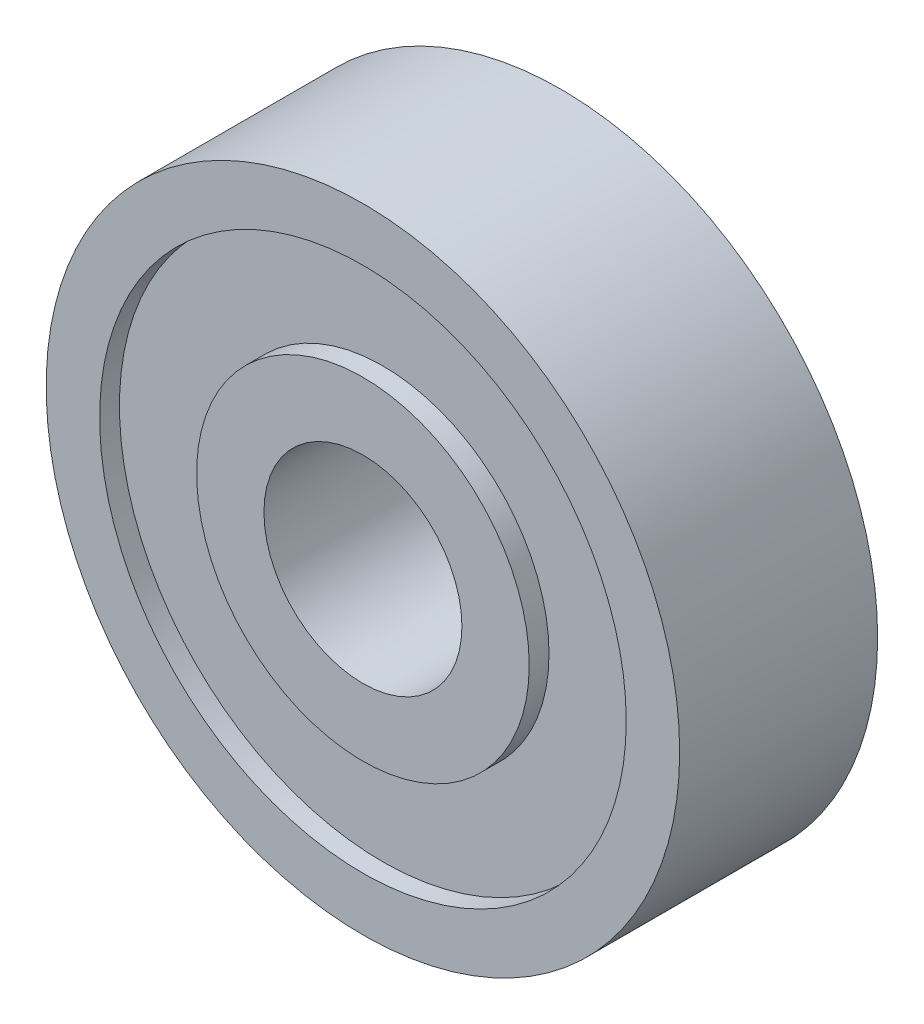
ISO-10303-21;
HEADER;
FILE_DESCRIPTION(('STEP AP214'),'2;1');
FILE_NAME('part.step','',(''),(''),'','','');
FILE_SCHEMA(('AUTOMOTIVE_DESIGN { 1 0 10303 214 1 1 1 1 }'));
ENDSEC;
DATA;
#1=APPLICATION_CONTEXT('core data for automotive mechanical design processes');
#2=APPLICATION_PROTOCOL_DEFINITION('international standard','automotive_design',2000,#1);
#3=PRODUCT_CONTEXT('',#1,'mechanical');
#4=PRODUCT('Part','Part','',(#3));
#5=PRODUCT_RELATED_PRODUCT_CATEGORY('part','',(#4));
#6=PRODUCT_DEFINITION_FORMATION('','',#4);
#7=PRODUCT_DEFINITION_CONTEXT('part definition',#1,'design');
#8=PRODUCT_DEFINITION('design','',#6,#7);
#9=PRODUCT_DEFINITION_SHAPE('','',#8);
#10=(LENGTH_UNIT() NAMED_UNIT(*) SI_UNIT(.MILLI.,.METRE.));
#11=(NAMED_UNIT(*) PLANE_ANGLE_UNIT() SI_UNIT($,.RADIAN.));
#12=(NAMED_UNIT(*) SI_UNIT($,.STERADIAN.) SOLID_ANGLE_UNIT());
#13=UNCERTAINTY_MEASURE_WITH_UNIT(LENGTH_MEASURE(1.E-05),#10,'distance_accuracy_value','');
#14=(GEOMETRIC_REPRESENTATION_CONTEXT(3) GLOBAL_UNCERTAINTY_ASSIGNED_CONTEXT((#13)) GLOBAL_UNIT_ASSIGNED_CONTEXT((#10,
#11,#12)) REPRESENTATION_CONTEXT('',''));
#15=CARTESIAN_POINT('',(0.,0.,0.));
#16=DIRECTION('',(0.,0.,1.));
#17=DIRECTION('',(1.,0.,0.));
#18=AXIS2_PLACEMENT_3D('',#15,#16,#17);
#19=CARTESIAN_POINT('',(0.,0.,-2.5));
#20=DIRECTION('',(0.,0.,1.));
#21=DIRECTION('',(1.,0.,0.));
#22=AXIS2_PLACEMENT_3D('',#19,#20,#21);
#23=PLANE('',#22);
#24=CARTESIAN_POINT('',(0.,0.,-2.5));
#25=DIRECTION('',(0.,0.,1.));
#26=DIRECTION('',(1.,0.,0.));
#27=AXIS2_PLACEMENT_3D('',#24,#25,#26);
#28=CIRCLE('',#27,2.5);
#29=CARTESIAN_POINT('',(2.5,0.,-2.5));
#30=VERTEX_POINT('',#29);
#31=EDGE_CURVE('E43',#30,#30,#28,.T.);
#32=ORIENTED_EDGE('',*,*,#31,.T.);
#33=EDGE_LOOP('',(#32));
#34=FACE_BOUND('',#33,.T.);
#35=CARTESIAN_POINT('',(0.,0.,-2.5));
#36=DIRECTION('',(0.,0.,1.));
#37=DIRECTION('',(1.,0.,0.));
#38=AXIS2_PLACEMENT_3D('',#35,#36,#37);
#39=CIRCLE('',#38,4.2);
#40=CARTESIAN_POINT('',(4.2,0.,-2.5));
#41=VERTEX_POINT('',#40);
#42=EDGE_CURVE('E69',#41,#41,#39,.T.);
#43=ORIENTED_EDGE('',*,*,#42,.F.);
#44=EDGE_LOOP('',(#43));
#45=FACE_BOUND('',#44,.T.);
#46=ADVANCED_FACE('F32',(#34,#45),#23,.F.);
#47=CARTESIAN_POINT('',(0.,0.,2.5));
#48=DIRECTION('',(0.,0.,1.));
#49=DIRECTION('',(1.,0.,0.));
#50=AXIS2_PLACEMENT_3D('',#47,#48,#49);
#51=PLANE('',#50);
#52=CARTESIAN_POINT('',(0.,0.,2.5));
#53=DIRECTION('',(0.,0.,1.));
#54=DIRECTION('',(1.,0.,0.));
#55=AXIS2_PLACEMENT_3D('',#52,#53,#54);
#56=CIRCLE('',#55,2.5);
#57=CARTESIAN_POINT('',(2.5,0.,2.5));
#58=VERTEX_POINT('',#57);
#59=EDGE_CURVE('E45',#58,#58,#56,.T.);
#60=ORIENTED_EDGE('',*,*,#59,.F.);
#61=EDGE_LOOP('',(#60));
#62=FACE_BOUND('',#61,.T.);
#63=CARTESIAN_POINT('',(0.,0.,2.5));
#64=DIRECTION('',(0.,0.,1.));
#65=DIRECTION('',(1.,0.,0.));
#66=AXIS2_PLACEMENT_3D('',#63,#64,#65);
#67=CIRCLE('',#66,4.2);
#68=CARTESIAN_POINT('',(4.2,0.,2.5));
#69=VERTEX_POINT('',#68);
#70=EDGE_CURVE('E57',#69,#69,#67,.T.);
#71=ORIENTED_EDGE('',*,*,#70,.T.);
#72=EDGE_LOOP('',(#71));
#73=FACE_BOUND('',#72,.T.);
#74=ADVANCED_FACE('F85',(#62,#73),#51,.T.);
#75=CARTESIAN_POINT('',(0.,0.,2.5));
#76=DIRECTION('',(0.,0.,-1.));
#77=DIRECTION('',(-1.,0.,0.));
#78=AXIS2_PLACEMENT_3D('',#75,#76,#77);
#79=CYLINDRICAL_SURFACE('',#78,8.);
#80=CARTESIAN_POINT('',(0.,0.,2.5));
#81=DIRECTION('',(0.,0.,1.));
#82=DIRECTION('',(1.,0.,0.));
#83=AXIS2_PLACEMENT_3D('',#80,#81,#82);
#84=CIRCLE('',#83,8.);
#85=CARTESIAN_POINT('',(8.,0.,2.5));
#86=VERTEX_POINT('',#85);
#87=EDGE_CURVE('E10',#86,#86,#84,.T.);
#88=ORIENTED_EDGE('',*,*,#87,.F.);
#89=EDGE_LOOP('',(#88));
#90=FACE_BOUND('',#89,.T.);
#91=CARTESIAN_POINT('',(0.,0.,-2.5));
#92=DIRECTION('',(0.,0.,1.));
#93=DIRECTION('',(1.,0.,0.));
#94=AXIS2_PLACEMENT_3D('',#91,#92,#93);
#95=CIRCLE('',#94,8.);
#96=CARTESIAN_POINT('',(8.,0.,-2.5));
#97=VERTEX_POINT('',#96);
#98=EDGE_CURVE('E36',#97,#97,#95,.T.);
#99=ORIENTED_EDGE('',*,*,#98,.T.);
#100=EDGE_LOOP('',(#99));
#101=FACE_BOUND('',#100,.T.);
#102=ADVANCED_FACE('F34',(#90,#101),#79,.T.);
#103=CARTESIAN_POINT('',(0.,0.,2.5));
#104=DIRECTION('',(0.,0.,1.));
#105=DIRECTION('',(1.,0.,0.));
#106=AXIS2_PLACEMENT_3D('',#103,#104,#105);
#107=CIRCLE('',#106,6.65);
#108=CARTESIAN_POINT('',(6.65,0.,2.5));
#109=VERTEX_POINT('',#108);
#110=EDGE_CURVE('E51',#109,#109,#107,.T.);
#111=ORIENTED_EDGE('',*,*,#110,.F.);
#112=EDGE_LOOP('',(#111));
#113=FACE_BOUND('',#112,.T.);
#114=ORIENTED_EDGE('',*,*,#87,.T.);
#115=EDGE_LOOP('',(#114));
#116=FACE_BOUND('',#115,.T.);
#117=ADVANCED_FACE('F93',(#113,#116),#51,.T.);
#118=CARTESIAN_POINT('',(0.,0.,-2.5));
#119=DIRECTION('',(0.,0.,1.));
#120=DIRECTION('',(1.,0.,0.));
#121=AXIS2_PLACEMENT_3D('',#118,#119,#120);
#122=CIRCLE('',#121,6.65);
#123=CARTESIAN_POINT('',(6.65,0.,-2.5));
#124=VERTEX_POINT('',#123);
#125=EDGE_CURVE('E63',#124,#124,#122,.T.);
#126=ORIENTED_EDGE('',*,*,#125,.T.);
#127=EDGE_LOOP('',(#126));
#128=FACE_BOUND('',#127,.T.);
#129=ORIENTED_EDGE('',*,*,#98,.F.);
#130=EDGE_LOOP('',(#129));
#131=FACE_BOUND('',#130,.T.);
#132=ADVANCED_FACE('F87',(#128,#131),#23,.F.);
#133=CARTESIAN_POINT('',(0.,0.,-2.5));
#134=DIRECTION('',(0.,0.,1.));
#135=DIRECTION('',(1.,0.,0.));
#136=AXIS2_PLACEMENT_3D('',#133,#134,#135);
#137=CYLINDRICAL_SURFACE('',#136,2.5);
#138=ORIENTED_EDGE('',*,*,#31,.F.);
#139=EDGE_LOOP('',(#138));
#140=FACE_BOUND('',#139,.T.);
#141=ORIENTED_EDGE('',*,*,#59,.T.);
#142=EDGE_LOOP('',(#141));
#143=FACE_BOUND('',#142,.T.);
#144=ADVANCED_FACE('F95',(#140,#143),#137,.F.);
#145=CARTESIAN_POINT('',(0.,0.,2.));
#146=DIRECTION('',(0.,0.,1.));
#147=DIRECTION('',(1.,0.,0.));
#148=AXIS2_PLACEMENT_3D('',#145,#146,#147);
#149=CYLINDRICAL_SURFACE('',#148,6.65);
#150=CARTESIAN_POINT('',(0.,0.,2.));
#151=DIRECTION('',(0.,0.,1.));
#152=DIRECTION('',(1.,0.,0.));
#153=AXIS2_PLACEMENT_3D('',#150,#151,#152);
#154=CIRCLE('',#153,6.65);
#155=CARTESIAN_POINT('',(6.65,0.,2.));
#156=VERTEX_POINT('',#155);
#157=EDGE_CURVE('E48',#156,#156,#154,.T.);
#158=ORIENTED_EDGE('',*,*,#157,.F.);
#159=EDGE_LOOP('',(#158));
#160=FACE_BOUND('',#159,.T.);
#161=ORIENTED_EDGE('',*,*,#110,.T.);
#162=EDGE_LOOP('',(#161));
#163=FACE_BOUND('',#162,.T.);
#164=ADVANCED_FACE('F101',(#160,#163),#149,.F.);
#165=CARTESIAN_POINT('',(0.,0.,2.));
#166=DIRECTION('',(0.,0.,1.));
#167=DIRECTION('',(1.,0.,0.));
#168=AXIS2_PLACEMENT_3D('',#165,#166,#167);
#169=PLANE('',#168);
#170=CARTESIAN_POINT('',(0.,0.,2.));
#171=DIRECTION('',(0.,0.,1.));
#172=DIRECTION('',(1.,0.,0.));
#173=AXIS2_PLACEMENT_3D('',#170,#171,#172);
#174=CIRCLE('',#173,4.2);
#175=CARTESIAN_POINT('',(4.2,0.,2.));
#176=VERTEX_POINT('',#175);
#177=EDGE_CURVE('E54',#176,#176,#174,.T.);
#178=ORIENTED_EDGE('',*,*,#177,.F.);
#179=EDGE_LOOP('',(#178));
#180=FACE_BOUND('',#179,.T.);
#181=ORIENTED_EDGE('',*,*,#157,.T.);
#182=EDGE_LOOP('',(#181));
#183=FACE_BOUND('',#182,.T.);
#184=ADVANCED_FACE('F132',(#180,#183),#169,.T.);
#185=CARTESIAN_POINT('',(0.,0.,2.));
#186=DIRECTION('',(0.,0.,1.));
#187=DIRECTION('',(1.,0.,0.));
#188=AXIS2_PLACEMENT_3D('',#185,#186,#187);
#189=CYLINDRICAL_SURFACE('',#188,4.2);
#190=ORIENTED_EDGE('',*,*,#177,.T.);
#191=EDGE_LOOP('',(#190));
#192=FACE_BOUND('',#191,.T.);
#193=ORIENTED_EDGE('',*,*,#70,.F.);
#194=EDGE_LOOP('',(#193));
#195=FACE_BOUND('',#194,.T.);
#196=ADVANCED_FACE('F142',(#192,#195),#189,.T.);
#197=CARTESIAN_POINT('',(0.,0.,-2.));
#198=DIRECTION('',(0.,0.,-1.));
#199=DIRECTION('',(1.,0.,0.));
#200=AXIS2_PLACEMENT_3D('',#197,#198,#199);
#201=PLANE('',#200);
#202=CARTESIAN_POINT('',(0.,0.,-2.));
#203=DIRECTION('',(0.,0.,1.));
#204=DIRECTION('',(1.,0.,0.));
#205=AXIS2_PLACEMENT_3D('',#202,#203,#204);
#206=CIRCLE('',#205,6.65);
#207=CARTESIAN_POINT('',(6.65,0.,-2.));
#208=VERTEX_POINT('',#207);
#209=EDGE_CURVE('E60',#208,#208,#206,.T.);
#210=ORIENTED_EDGE('',*,*,#209,.F.);
#211=EDGE_LOOP('',(#210));
#212=FACE_BOUND('',#211,.T.);
#213=CARTESIAN_POINT('',(0.,0.,-2.));
#214=DIRECTION('',(0.,0.,1.));
#215=DIRECTION('',(1.,0.,0.));
#216=AXIS2_PLACEMENT_3D('',#213,#214,#215);
#217=CIRCLE('',#216,4.2);
#218=CARTESIAN_POINT('',(4.2,0.,-2.));
#219=VERTEX_POINT('',#218);
#220=EDGE_CURVE('E66',#219,#219,#217,.T.);
#221=ORIENTED_EDGE('',*,*,#220,.T.);
#222=EDGE_LOOP('',(#221));
#223=FACE_BOUND('',#222,.T.);
#224=ADVANCED_FACE('F75',(#212,#223),#201,.T.);
#225=CARTESIAN_POINT('',(0.,0.,-2.));
#226=DIRECTION('',(0.,0.,-1.));
#227=DIRECTION('',(-1.,0.,0.));
#228=AXIS2_PLACEMENT_3D('',#225,#226,#227);
#229=CYLINDRICAL_SURFACE('',#228,6.65);
#230=ORIENTED_EDGE('',*,*,#209,.T.);
#231=EDGE_LOOP('',(#230));
#232=FACE_BOUND('',#231,.T.);
#233=ORIENTED_EDGE('',*,*,#125,.F.);
#234=EDGE_LOOP('',(#233));
#235=FACE_BOUND('',#234,.T.);
#236=ADVANCED_FACE('F80',(#232,#235),#229,.F.);
#237=CARTESIAN_POINT('',(0.,0.,-2.));
#238=DIRECTION('',(0.,0.,-1.));
#239=DIRECTION('',(-1.,0.,0.));
#240=AXIS2_PLACEMENT_3D('',#237,#238,#239);
#241=CYLINDRICAL_SURFACE('',#240,4.2);
#242=ORIENTED_EDGE('',*,*,#220,.F.);
#243=EDGE_LOOP('',(#242));
#244=FACE_BOUND('',#243,.T.);
#245=ORIENTED_EDGE('',*,*,#42,.T.);
#246=EDGE_LOOP('',(#245));
#247=FACE_BOUND('',#246,.T.);
#248=ADVANCED_FACE('F77',(#244,#247),#241,.T.);
#249=CLOSED_SHELL('',(#46,#74,#102,#117,#132,#144,#164,#184,#196,#224,#236,#248));
#250=MANIFOLD_SOLID_BREP('B2',#249);
#251=ADVANCED_BREP_SHAPE_REPRESENTATION('',(#18,#250),#14);
#252=SHAPE_DEFINITION_REPRESENTATION(#9,#251);
ENDSEC;
END-ISO-10303-21;
